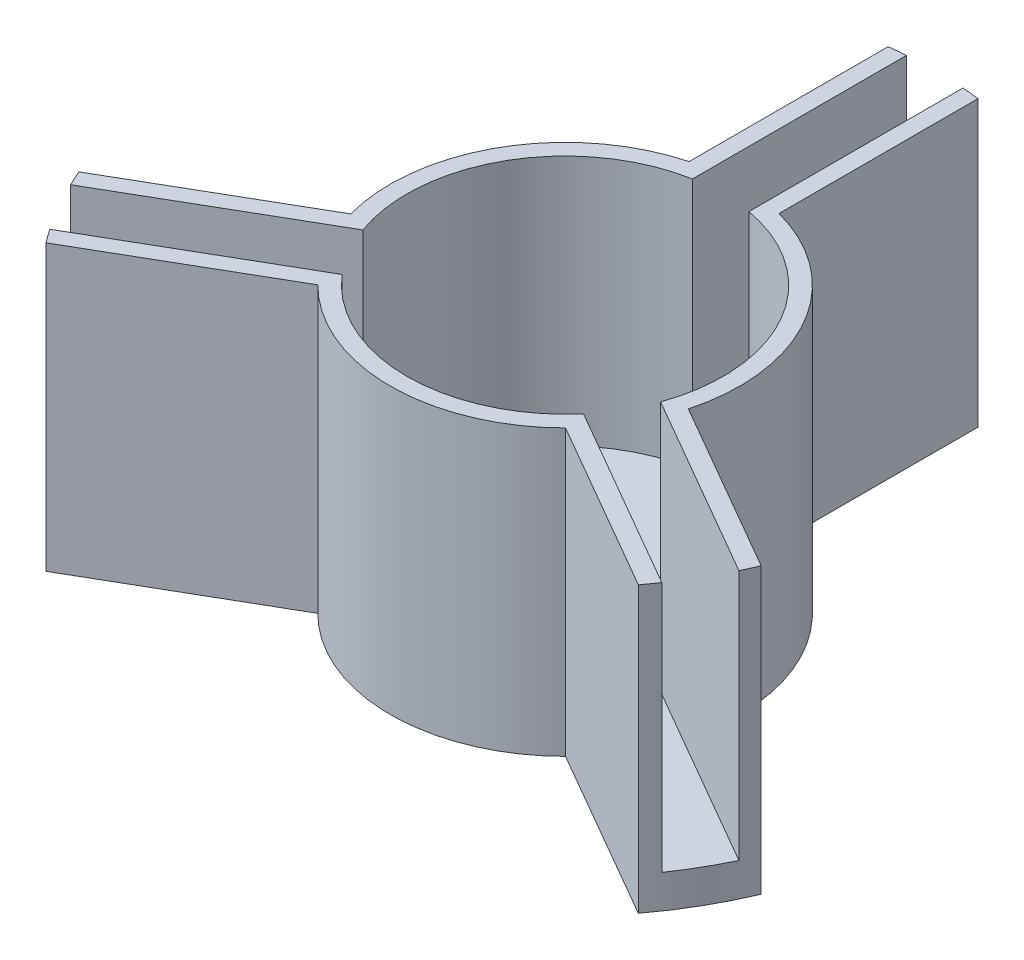
ISO-10303-21;
HEADER;
FILE_DESCRIPTION(('STEP AP214'),'2;1');
FILE_NAME('part.step','',(''),(''),'','','');
FILE_SCHEMA(('AUTOMOTIVE_DESIGN { 1 0 10303 214 1 1 1 1 }'));
ENDSEC;
DATA;
#1=APPLICATION_CONTEXT('core data for automotive mechanical design processes');
#2=APPLICATION_PROTOCOL_DEFINITION('international standard','automotive_design',2000,#1);
#3=PRODUCT_CONTEXT('',#1,'mechanical');
#4=PRODUCT('Part','Part','',(#3));
#5=PRODUCT_RELATED_PRODUCT_CATEGORY('part','',(#4));
#6=PRODUCT_DEFINITION_FORMATION('','',#4);
#7=PRODUCT_DEFINITION_CONTEXT('part definition',#1,'design');
#8=PRODUCT_DEFINITION('design','',#6,#7);
#9=PRODUCT_DEFINITION_SHAPE('','',#8);
#10=(LENGTH_UNIT() NAMED_UNIT(*) SI_UNIT(.MILLI.,.METRE.));
#11=(NAMED_UNIT(*) PLANE_ANGLE_UNIT() SI_UNIT($,.RADIAN.));
#12=(NAMED_UNIT(*) SI_UNIT($,.STERADIAN.) SOLID_ANGLE_UNIT());
#13=UNCERTAINTY_MEASURE_WITH_UNIT(LENGTH_MEASURE(1.E-05),#10,'distance_accuracy_value','');
#14=(GEOMETRIC_REPRESENTATION_CONTEXT(3) GLOBAL_UNCERTAINTY_ASSIGNED_CONTEXT((#13)) GLOBAL_UNIT_ASSIGNED_CONTEXT((#10,
#11,#12)) REPRESENTATION_CONTEXT('',''));
#15=CARTESIAN_POINT('',(0.,0.,0.));
#16=DIRECTION('',(0.,0.,1.));
#17=DIRECTION('',(1.,0.,0.));
#18=AXIS2_PLACEMENT_3D('',#15,#16,#17);
#19=CARTESIAN_POINT('',(0.,15.,0.));
#20=DIRECTION('',(0.,-1.,0.));
#21=DIRECTION('',(0.,0.,-1.));
#22=AXIS2_PLACEMENT_3D('',#19,#20,#21);
#23=CYLINDRICAL_SURFACE('',#22,22.15);
#24=CARTESIAN_POINT('',(0.,15.,0.));
#25=DIRECTION('',(0.,1.,0.));
#26=DIRECTION('',(0.,0.,1.));
#27=AXIS2_PLACEMENT_3D('',#24,#25,#26);
#28=CIRCLE('',#27,22.15);
#29=CARTESIAN_POINT('',(17.6969927064308,15.,13.3206211997991));
#30=VERTEX_POINT('',#29);
#31=CARTESIAN_POINT('',(18.2829625458743,15.,12.5042305059591));
#32=VERTEX_POINT('',#31);
#33=EDGE_CURVE('E51',#30,#32,#28,.T.);
#34=ORIENTED_EDGE('',*,*,#33,.F.);
#35=DIRECTION('',(0.,1.,0.));
#36=VECTOR('',#35,1.);
#37=CARTESIAN_POINT('',(17.6969927064308,-40.3534182513635,13.3206211997991));
#38=LINE('',#37,#36);
#39=CARTESIAN_POINT('',(17.6969927064308,-2.,13.3206211997991));
#40=VERTEX_POINT('',#39);
#41=EDGE_CURVE('E237',#40,#30,#38,.T.);
#42=ORIENTED_EDGE('',*,*,#41,.F.);
#43=CARTESIAN_POINT('',(0.,-2.,0.));
#44=DIRECTION('',(0.,-1.,0.));
#45=DIRECTION('',(0.,0.,-1.));
#46=AXIS2_PLACEMENT_3D('',#43,#44,#45);
#47=CIRCLE('',#46,22.15);
#48=CARTESIAN_POINT('',(20.3844927064308,-2.,8.66573465445768));
#49=VERTEX_POINT('',#48);
#50=EDGE_CURVE('E226',#49,#40,#47,.T.);
#51=ORIENTED_EDGE('',*,*,#50,.F.);
#52=DIRECTION('',(0.,1.,0.));
#53=VECTOR('',#52,1.);
#54=CARTESIAN_POINT('',(20.3844927064308,-38.3089459886184,8.66573465445768));
#55=LINE('',#54,#53);
#56=CARTESIAN_POINT('',(20.3844927064308,15.,8.66573465445768));
#57=VERTEX_POINT('',#56);
#58=EDGE_CURVE('E67',#49,#57,#55,.T.);
#59=ORIENTED_EDGE('',*,*,#58,.T.);
#60=CARTESIAN_POINT('',(19.9704625458742,15.,9.58139476818661));
#61=VERTEX_POINT('',#60);
#62=EDGE_CURVE('E372',#61,#57,#28,.T.);
#63=ORIENTED_EDGE('',*,*,#62,.F.);
#64=DIRECTION('',(0.,1.,0.));
#65=VECTOR('',#64,1.);
#66=CARTESIAN_POINT('',(19.9704625458742,-15.8007213444474,9.58139476818661));
#67=LINE('',#66,#65);
#68=CARTESIAN_POINT('',(19.9704625458742,0.,9.58139476818661));
#69=VERTEX_POINT('',#68);
#70=EDGE_CURVE('E296',#69,#61,#67,.T.);
#71=ORIENTED_EDGE('',*,*,#70,.F.);
#72=CARTESIAN_POINT('',(0.,0.,0.));
#73=DIRECTION('',(0.,-1.,0.));
#74=DIRECTION('',(0.,0.,-1.));
#75=AXIS2_PLACEMENT_3D('',#72,#73,#74);
#76=CIRCLE('',#75,22.15);
#77=CARTESIAN_POINT('',(18.2829625458743,0.,12.5042305059591));
#78=VERTEX_POINT('',#77);
#79=EDGE_CURVE('E322',#78,#69,#76,.F.);
#80=ORIENTED_EDGE('',*,*,#79,.F.);
#81=DIRECTION('',(0.,1.,0.));
#82=VECTOR('',#81,1.);
#83=CARTESIAN_POINT('',(18.2829625458743,-15.8007213444474,12.5042305059591));
#84=LINE('',#83,#82);
#85=EDGE_CURVE('E325',#78,#32,#84,.T.);
#86=ORIENTED_EDGE('',*,*,#85,.T.);
#87=EDGE_LOOP('',(#34,#42,#51,#59,#63,#71,#80,#86));
#88=FACE_BOUND('',#87,.T.);
#89=ADVANCED_FACE('F41',(#88),#23,.T.);
#90=CARTESIAN_POINT('',(2.68750000000006,15.,-21.9863558542565));
#91=VERTEX_POINT('',#90);
#92=CARTESIAN_POINT('',(1.6875,15.,-22.0856252741461));
#93=VERTEX_POINT('',#92);
#94=EDGE_CURVE('E366',#91,#93,#28,.T.);
#95=ORIENTED_EDGE('',*,*,#94,.F.);
#96=DIRECTION('',(0.,1.,0.));
#97=VECTOR('',#96,1.);
#98=CARTESIAN_POINT('',(2.68750000000006,-38.3089459886184,-21.9863558542565));
#99=LINE('',#98,#97);
#100=CARTESIAN_POINT('',(2.68750000000006,-2.,-21.9863558542565));
#101=VERTEX_POINT('',#100);
#102=EDGE_CURVE('E259',#101,#91,#99,.T.);
#103=ORIENTED_EDGE('',*,*,#102,.F.);
#104=CARTESIAN_POINT('',(-2.6875,-2.,-21.9863558542565));
#105=VERTEX_POINT('',#104);
#106=EDGE_CURVE('E360',#105,#101,#47,.T.);
#107=ORIENTED_EDGE('',*,*,#106,.F.);
#108=DIRECTION('',(0.,1.,0.));
#109=VECTOR('',#108,1.);
#110=CARTESIAN_POINT('',(-2.6875,-38.3089459886183,-21.9863558542565));
#111=LINE('',#110,#109);
#112=CARTESIAN_POINT('',(-2.6875,15.,-21.9863558542565));
#113=VERTEX_POINT('',#112);
#114=EDGE_CURVE('E278',#105,#113,#111,.T.);
#115=ORIENTED_EDGE('',*,*,#114,.T.);
#116=CARTESIAN_POINT('',(-1.6875,15.,-22.0856252741461));
#117=VERTEX_POINT('',#116);
#118=EDGE_CURVE('E11',#117,#113,#28,.T.);
#119=ORIENTED_EDGE('',*,*,#118,.F.);
#120=DIRECTION('',(0.,1.,0.));
#121=VECTOR('',#120,1.);
#122=CARTESIAN_POINT('',(-1.6875,-13.2876525247853,-22.0856252741461));
#123=LINE('',#122,#121);
#124=CARTESIAN_POINT('',(-1.6875,0.,-22.0856252741461));
#125=VERTEX_POINT('',#124);
#126=EDGE_CURVE('E346',#125,#117,#123,.T.);
#127=ORIENTED_EDGE('',*,*,#126,.F.);
#128=CARTESIAN_POINT('',(0.,0.,0.));
#129=DIRECTION('',(0.,-1.,0.));
#130=DIRECTION('',(0.,0.,-1.));
#131=AXIS2_PLACEMENT_3D('',#128,#129,#130);
#132=CIRCLE('',#131,22.15);
#133=CARTESIAN_POINT('',(1.6875,0.,-22.0856252741461));
#134=VERTEX_POINT('',#133);
#135=EDGE_CURVE('E343',#134,#125,#132,.F.);
#136=ORIENTED_EDGE('',*,*,#135,.F.);
#137=DIRECTION('',(0.,1.,0.));
#138=VECTOR('',#137,1.);
#139=CARTESIAN_POINT('',(1.6875,-13.2876525247853,-22.0856252741461));
#140=LINE('',#139,#138);
#141=EDGE_CURVE('E347',#134,#93,#140,.T.);
#142=ORIENTED_EDGE('',*,*,#141,.T.);
#143=EDGE_LOOP('',(#95,#103,#107,#115,#119,#127,#136,#142));
#144=FACE_BOUND('',#143,.T.);
#145=ADVANCED_FACE('F403',(#144),#23,.T.);
#146=CARTESIAN_POINT('',(0.,15.,0.));
#147=DIRECTION('',(0.,-1.,0.));
#148=DIRECTION('',(0.,0.,-1.));
#149=AXIS2_PLACEMENT_3D('',#146,#147,#148);
#150=CYLINDRICAL_SURFACE('',#149,9.45);
#151=DIRECTION('',(0.,1.,0.));
#152=VECTOR('',#151,1.);
#153=CARTESIAN_POINT('',(-7.20864919604707,-15.8007213444474,6.11047271234639));
#154=LINE('',#153,#152);
#155=CARTESIAN_POINT('',(-7.20864919604707,0.,6.11047271234639));
#156=VERTEX_POINT('',#155);
#157=CARTESIAN_POINT('',(-7.20864919604707,15.,6.11047271234639));
#158=VERTEX_POINT('',#157);
#159=EDGE_CURVE('E298',#156,#158,#154,.T.);
#160=ORIENTED_EDGE('',*,*,#159,.T.);
#161=CARTESIAN_POINT('',(0.,15.,0.));
#162=DIRECTION('',(0.,1.,0.));
#163=DIRECTION('',(0.,0.,1.));
#164=AXIS2_PLACEMENT_3D('',#161,#162,#163);
#165=CIRCLE('',#164,9.45);
#166=CARTESIAN_POINT('',(7.20864919604716,15.,6.11047271234629));
#167=VERTEX_POINT('',#166);
#168=EDGE_CURVE('E367',#158,#167,#165,.T.);
#169=ORIENTED_EDGE('',*,*,#168,.T.);
#170=DIRECTION('',(0.,1.,0.));
#171=VECTOR('',#170,1.);
#172=CARTESIAN_POINT('',(7.20864919604716,-15.8007213444474,6.11047271234629));
#173=LINE('',#172,#171);
#174=CARTESIAN_POINT('',(7.20864919604716,0.,6.11047271234629));
#175=VERTEX_POINT('',#174);
#176=EDGE_CURVE('E329',#175,#167,#173,.T.);
#177=ORIENTED_EDGE('',*,*,#176,.F.);
#178=CARTESIAN_POINT('',(0.,0.,0.));
#179=DIRECTION('',(0.,1.,0.));
#180=DIRECTION('',(0.,0.,1.));
#181=AXIS2_PLACEMENT_3D('',#178,#179,#180);
#182=CIRCLE('',#181,9.45);
#183=EDGE_CURVE('E378',#156,#175,#182,.T.);
#184=ORIENTED_EDGE('',*,*,#183,.F.);
#185=EDGE_LOOP('',(#160,#169,#177,#184));
#186=FACE_BOUND('',#185,.T.);
#187=ADVANCED_FACE('F393',(#186),#150,.F.);
#188=DIRECTION('',(0.,1.,0.));
#189=VECTOR('',#188,1.);
#190=CARTESIAN_POINT('',(8.89614919604713,-15.8007213444474,3.1876369745738));
#191=LINE('',#190,#189);
#192=CARTESIAN_POINT('',(8.89614919604713,0.,3.1876369745738));
#193=VERTEX_POINT('',#192);
#194=CARTESIAN_POINT('',(8.89614919604713,15.,3.1876369745738));
#195=VERTEX_POINT('',#194);
#196=EDGE_CURVE('E321',#193,#195,#191,.T.);
#197=ORIENTED_EDGE('',*,*,#196,.T.);
#198=CARTESIAN_POINT('',(1.6875,15.,-9.29810968692024));
#199=VERTEX_POINT('',#198);
#200=EDGE_CURVE('E368',#195,#199,#165,.T.);
#201=ORIENTED_EDGE('',*,*,#200,.T.);
#202=DIRECTION('',(0.,1.,0.));
#203=VECTOR('',#202,1.);
#204=CARTESIAN_POINT('',(1.6875,-13.2876525247853,-9.29810968692024));
#205=LINE('',#204,#203);
#206=CARTESIAN_POINT('',(1.6875,0.,-9.29810968692024));
#207=VERTEX_POINT('',#206);
#208=EDGE_CURVE('E351',#207,#199,#205,.T.);
#209=ORIENTED_EDGE('',*,*,#208,.F.);
#210=EDGE_CURVE('E363',#193,#207,#182,.T.);
#211=ORIENTED_EDGE('',*,*,#210,.F.);
#212=EDGE_LOOP('',(#197,#201,#209,#211));
#213=FACE_BOUND('',#212,.T.);
#214=ADVANCED_FACE('F390',(#213),#150,.F.);
#215=CARTESIAN_POINT('',(0.,15.,0.));
#216=DIRECTION('',(0.,1.,0.));
#217=DIRECTION('',(0.,0.,1.));
#218=AXIS2_PLACEMENT_3D('',#215,#216,#217);
#219=PLANE('',#218);
#220=DIRECTION('',(-0.866025403784434,0.,-0.500000000000008));
#221=VECTOR('',#220,1.);
#222=CARTESIAN_POINT('',(17.6969927064308,15.,13.3206211997991));
#223=LINE('',#222,#221);
#224=CARTESIAN_POINT('',(7.40181360748119,15.,7.376696775665));
#225=VERTEX_POINT('',#224);
#226=EDGE_CURVE('E220',#30,#225,#223,.T.);
#227=ORIENTED_EDGE('',*,*,#226,.F.);
#228=ORIENTED_EDGE('',*,*,#33,.T.);
#229=DIRECTION('',(0.866025403784443,0.,0.499999999999992));
#230=VECTOR('',#229,1.);
#231=CARTESIAN_POINT('',(7.20864919604716,15.,6.11047271234629));
#232=LINE('',#231,#230);
#233=EDGE_CURVE('E315',#167,#32,#232,.T.);
#234=ORIENTED_EDGE('',*,*,#233,.F.);
#235=ORIENTED_EDGE('',*,*,#168,.F.);
#236=DIRECTION('',(0.866025403784436,0.,-0.500000000000004));
#237=VECTOR('',#236,1.);
#238=CARTESIAN_POINT('',(-18.2829625458741,15.,12.5042305059594));
#239=LINE('',#238,#237);
#240=CARTESIAN_POINT('',(-18.2829625458741,15.,12.5042305059594));
#241=VERTEX_POINT('',#240);
#242=EDGE_CURVE('E294',#241,#158,#239,.T.);
#243=ORIENTED_EDGE('',*,*,#242,.F.);
#244=CARTESIAN_POINT('',(-17.696992706431,15.,13.3206211997988));
#245=VERTEX_POINT('',#244);
#246=EDGE_CURVE('E52',#241,#245,#28,.T.);
#247=ORIENTED_EDGE('',*,*,#246,.T.);
#248=DIRECTION('',(-0.866025403784443,0.,0.499999999999992));
#249=VECTOR('',#248,1.);
#250=CARTESIAN_POINT('',(-17.696992706431,15.,13.3206211997988));
#251=LINE('',#250,#249);
#252=CARTESIAN_POINT('',(-7.40181360748129,15.,7.37669677566489));
#253=VERTEX_POINT('',#252);
#254=EDGE_CURVE('E227',#253,#245,#251,.T.);
#255=ORIENTED_EDGE('',*,*,#254,.F.);
#256=CARTESIAN_POINT('',(0.,15.,0.));
#257=DIRECTION('',(0.,-1.,0.));
#258=DIRECTION('',(0.866025403784443,0.,-0.499999999999992));
#259=AXIS2_PLACEMENT_3D('',#256,#257,#258);
#260=CIRCLE('',#259,10.45);
#261=EDGE_CURVE('E229',#225,#253,#260,.T.);
#262=ORIENTED_EDGE('',*,*,#261,.F.);
#263=EDGE_LOOP('',(#227,#228,#234,#235,#243,#247,#255,#262));
#264=FACE_BOUND('',#263,.T.);
#265=ADVANCED_FACE('F392',(#264),#219,.T.);
#266=DIRECTION('',(0.,0.,1.));
#267=VECTOR('',#266,1.);
#268=CARTESIAN_POINT('',(2.68750000000006,15.,-21.9863558542565));
#269=LINE('',#268,#267);
#270=CARTESIAN_POINT('',(2.68750000000001,15.,-10.0985070059886));
#271=VERTEX_POINT('',#270);
#272=EDGE_CURVE('E240',#91,#271,#269,.T.);
#273=ORIENTED_EDGE('',*,*,#272,.F.);
#274=ORIENTED_EDGE('',*,*,#94,.T.);
#275=DIRECTION('',(0.,0.,-1.));
#276=VECTOR('',#275,1.);
#277=CARTESIAN_POINT('',(1.6875,15.,-9.29810968692024));
#278=LINE('',#277,#276);
#279=EDGE_CURVE('E336',#199,#93,#278,.T.);
#280=ORIENTED_EDGE('',*,*,#279,.F.);
#281=ORIENTED_EDGE('',*,*,#200,.F.);
#282=DIRECTION('',(-0.866025403784443,0.,-0.499999999999992));
#283=VECTOR('',#282,1.);
#284=CARTESIAN_POINT('',(19.9704625458742,15.,9.58139476818661));
#285=LINE('',#284,#283);
#286=EDGE_CURVE('E289',#61,#195,#285,.T.);
#287=ORIENTED_EDGE('',*,*,#286,.F.);
#288=ORIENTED_EDGE('',*,*,#62,.T.);
#289=DIRECTION('',(0.866025403784436,0.,0.500000000000004));
#290=VECTOR('',#289,1.);
#291=CARTESIAN_POINT('',(20.3844927064308,15.,8.66573465445768));
#292=LINE('',#291,#290);
#293=CARTESIAN_POINT('',(10.0893136074812,15.,2.72181023032365));
#294=VERTEX_POINT('',#293);
#295=EDGE_CURVE('E241',#294,#57,#292,.T.);
#296=ORIENTED_EDGE('',*,*,#295,.F.);
#297=CARTESIAN_POINT('',(0.,15.,0.));
#298=DIRECTION('',(0.,-1.,0.));
#299=DIRECTION('',(-0.866025403784436,0.,-0.500000000000004));
#300=AXIS2_PLACEMENT_3D('',#297,#298,#299);
#301=CIRCLE('',#300,10.45);
#302=EDGE_CURVE('E244',#271,#294,#301,.T.);
#303=ORIENTED_EDGE('',*,*,#302,.F.);
#304=EDGE_LOOP('',(#273,#274,#280,#281,#287,#288,#296,#303));
#305=FACE_BOUND('',#304,.T.);
#306=ADVANCED_FACE('F399',(#305),#219,.T.);
#307=DIRECTION('',(0.,1.,0.));
#308=VECTOR('',#307,1.);
#309=CARTESIAN_POINT('',(-8.89614919604709,-15.8007213444474,3.18763697457392));
#310=LINE('',#309,#308);
#311=CARTESIAN_POINT('',(-8.89614919604709,0.,3.18763697457392));
#312=VERTEX_POINT('',#311);
#313=CARTESIAN_POINT('',(-8.89614919604709,15.,3.18763697457392));
#314=VERTEX_POINT('',#313);
#315=EDGE_CURVE('E307',#312,#314,#310,.T.);
#316=ORIENTED_EDGE('',*,*,#315,.F.);
#317=CARTESIAN_POINT('',(-1.6875,0.,-9.29810968692024));
#318=VERTEX_POINT('',#317);
#319=EDGE_CURVE('E45',#318,#312,#182,.T.);
#320=ORIENTED_EDGE('',*,*,#319,.F.);
#321=DIRECTION('',(0.,1.,0.));
#322=VECTOR('',#321,1.);
#323=CARTESIAN_POINT('',(-1.6875,-13.2876525247853,-9.29810968692024));
#324=LINE('',#323,#322);
#325=CARTESIAN_POINT('',(-1.6875,15.,-9.29810968692024));
#326=VERTEX_POINT('',#325);
#327=EDGE_CURVE('E342',#318,#326,#324,.T.);
#328=ORIENTED_EDGE('',*,*,#327,.T.);
#329=EDGE_CURVE('E364',#326,#314,#165,.T.);
#330=ORIENTED_EDGE('',*,*,#329,.T.);
#331=EDGE_LOOP('',(#316,#320,#328,#330));
#332=FACE_BOUND('',#331,.T.);
#333=ADVANCED_FACE('F43',(#332),#150,.F.);
#334=CARTESIAN_POINT('',(-17.696992706431,-2.,13.3206211997988));
#335=VERTEX_POINT('',#334);
#336=CARTESIAN_POINT('',(-20.3844927064308,-2.,8.66573465445762));
#337=VERTEX_POINT('',#336);
#338=EDGE_CURVE('E359',#335,#337,#47,.T.);
#339=ORIENTED_EDGE('',*,*,#338,.F.);
#340=DIRECTION('',(0.,1.,0.));
#341=VECTOR('',#340,1.);
#342=CARTESIAN_POINT('',(-17.696992706431,-40.3534182513635,13.3206211997988));
#343=LINE('',#342,#341);
#344=EDGE_CURVE('E59',#335,#245,#343,.T.);
#345=ORIENTED_EDGE('',*,*,#344,.T.);
#346=ORIENTED_EDGE('',*,*,#246,.F.);
#347=DIRECTION('',(0.,1.,0.));
#348=VECTOR('',#347,1.);
#349=CARTESIAN_POINT('',(-18.2829625458741,-15.8007213444474,12.5042305059594));
#350=LINE('',#349,#348);
#351=CARTESIAN_POINT('',(-18.2829625458741,0.,12.5042305059594));
#352=VERTEX_POINT('',#351);
#353=EDGE_CURVE('E302',#352,#241,#350,.T.);
#354=ORIENTED_EDGE('',*,*,#353,.F.);
#355=CARTESIAN_POINT('',(0.,0.,0.));
#356=DIRECTION('',(0.,-1.,0.));
#357=DIRECTION('',(0.,0.,-1.));
#358=AXIS2_PLACEMENT_3D('',#355,#356,#357);
#359=CIRCLE('',#358,22.15);
#360=CARTESIAN_POINT('',(-19.9704625458741,0.,9.58139476818689));
#361=VERTEX_POINT('',#360);
#362=EDGE_CURVE('E299',#361,#352,#359,.F.);
#363=ORIENTED_EDGE('',*,*,#362,.F.);
#364=DIRECTION('',(0.,1.,0.));
#365=VECTOR('',#364,1.);
#366=CARTESIAN_POINT('',(-19.9704625458741,-15.8007213444474,9.58139476818689));
#367=LINE('',#366,#365);
#368=CARTESIAN_POINT('',(-19.9704625458741,15.,9.58139476818689));
#369=VERTEX_POINT('',#368);
#370=EDGE_CURVE('E303',#361,#369,#367,.T.);
#371=ORIENTED_EDGE('',*,*,#370,.T.);
#372=CARTESIAN_POINT('',(-20.3844927064308,15.,8.66573465445762));
#373=VERTEX_POINT('',#372);
#374=EDGE_CURVE('E50',#373,#369,#28,.T.);
#375=ORIENTED_EDGE('',*,*,#374,.F.);
#376=DIRECTION('',(0.,1.,0.));
#377=VECTOR('',#376,1.);
#378=CARTESIAN_POINT('',(-20.3844927064308,-38.3089459886183,8.66573465445762));
#379=LINE('',#378,#377);
#380=EDGE_CURVE('E285',#337,#373,#379,.T.);
#381=ORIENTED_EDGE('',*,*,#380,.F.);
#382=EDGE_LOOP('',(#339,#345,#346,#354,#363,#371,#375,#381));
#383=FACE_BOUND('',#382,.T.);
#384=ADVANCED_FACE('F405',(#383),#23,.T.);
#385=DIRECTION('',(0.866025403784439,0.,-0.5));
#386=VECTOR('',#385,1.);
#387=CARTESIAN_POINT('',(-20.3844927064308,15.,8.66573465445762));
#388=LINE('',#387,#386);
#389=CARTESIAN_POINT('',(-10.0893136074812,15.,2.72181023032364));
#390=VERTEX_POINT('',#389);
#391=EDGE_CURVE('E263',#373,#390,#388,.T.);
#392=ORIENTED_EDGE('',*,*,#391,.F.);
#393=ORIENTED_EDGE('',*,*,#374,.T.);
#394=DIRECTION('',(-0.866025403784436,0.,0.500000000000004));
#395=VECTOR('',#394,1.);
#396=CARTESIAN_POINT('',(-8.89614919604709,15.,3.18763697457392));
#397=LINE('',#396,#395);
#398=EDGE_CURVE('E290',#314,#369,#397,.T.);
#399=ORIENTED_EDGE('',*,*,#398,.F.);
#400=ORIENTED_EDGE('',*,*,#329,.F.);
#401=DIRECTION('',(0.,0.,1.));
#402=VECTOR('',#401,1.);
#403=CARTESIAN_POINT('',(-1.6875,15.,-22.0856252741461));
#404=LINE('',#403,#402);
#405=EDGE_CURVE('E314',#117,#326,#404,.T.);
#406=ORIENTED_EDGE('',*,*,#405,.F.);
#407=ORIENTED_EDGE('',*,*,#118,.T.);
#408=DIRECTION('',(0.,0.,-1.));
#409=VECTOR('',#408,1.);
#410=CARTESIAN_POINT('',(-2.6875,15.,-21.9863558542565));
#411=LINE('',#410,#409);
#412=CARTESIAN_POINT('',(-2.6875,15.,-10.0985070059886));
#413=VERTEX_POINT('',#412);
#414=EDGE_CURVE('E264',#413,#113,#411,.T.);
#415=ORIENTED_EDGE('',*,*,#414,.F.);
#416=CARTESIAN_POINT('',(0.,15.,0.));
#417=DIRECTION('',(0.,-1.,0.));
#418=DIRECTION('',(0.,0.,1.));
#419=AXIS2_PLACEMENT_3D('',#416,#417,#418);
#420=CIRCLE('',#419,10.45);
#421=EDGE_CURVE('E267',#390,#413,#420,.T.);
#422=ORIENTED_EDGE('',*,*,#421,.F.);
#423=EDGE_LOOP('',(#392,#393,#399,#400,#406,#407,#415,#422));
#424=FACE_BOUND('',#423,.T.);
#425=ADVANCED_FACE('F402',(#424),#219,.T.);
#426=CARTESIAN_POINT('',(0.,0.,0.));
#427=DIRECTION('',(0.,-1.,0.));
#428=DIRECTION('',(0.,0.,-1.));
#429=AXIS2_PLACEMENT_3D('',#426,#427,#428);
#430=PLANE('',#429);
#431=ORIENTED_EDGE('',*,*,#319,.T.);
#432=DIRECTION('',(-0.866025403784436,0.,0.500000000000004));
#433=VECTOR('',#432,1.);
#434=CARTESIAN_POINT('',(-8.89614919604709,0.,3.18763697457392));
#435=LINE('',#434,#433);
#436=EDGE_CURVE('E304',#312,#361,#435,.T.);
#437=ORIENTED_EDGE('',*,*,#436,.T.);
#438=ORIENTED_EDGE('',*,*,#362,.T.);
#439=DIRECTION('',(0.866025403784436,0.,-0.500000000000004));
#440=VECTOR('',#439,1.);
#441=CARTESIAN_POINT('',(-18.2829625458741,0.,12.5042305059594));
#442=LINE('',#441,#440);
#443=EDGE_CURVE('E293',#352,#156,#442,.T.);
#444=ORIENTED_EDGE('',*,*,#443,.T.);
#445=ORIENTED_EDGE('',*,*,#183,.T.);
#446=DIRECTION('',(0.866025403784443,0.,0.499999999999992));
#447=VECTOR('',#446,1.);
#448=CARTESIAN_POINT('',(7.20864919604716,0.,6.11047271234629));
#449=LINE('',#448,#447);
#450=EDGE_CURVE('E326',#175,#78,#449,.T.);
#451=ORIENTED_EDGE('',*,*,#450,.T.);
#452=ORIENTED_EDGE('',*,*,#79,.T.);
#453=DIRECTION('',(-0.866025403784443,0.,-0.499999999999992));
#454=VECTOR('',#453,1.);
#455=CARTESIAN_POINT('',(19.9704625458742,0.,9.58139476818661));
#456=LINE('',#455,#454);
#457=EDGE_CURVE('E318',#69,#193,#456,.T.);
#458=ORIENTED_EDGE('',*,*,#457,.T.);
#459=ORIENTED_EDGE('',*,*,#210,.T.);
#460=DIRECTION('',(0.,0.,-1.));
#461=VECTOR('',#460,1.);
#462=CARTESIAN_POINT('',(1.6875,0.,-9.29810968692024));
#463=LINE('',#462,#461);
#464=EDGE_CURVE('E348',#207,#134,#463,.T.);
#465=ORIENTED_EDGE('',*,*,#464,.T.);
#466=ORIENTED_EDGE('',*,*,#135,.T.);
#467=DIRECTION('',(0.,0.,1.));
#468=VECTOR('',#467,1.);
#469=CARTESIAN_POINT('',(-1.6875,0.,-22.0856252741461));
#470=LINE('',#469,#468);
#471=EDGE_CURVE('E339',#125,#318,#470,.T.);
#472=ORIENTED_EDGE('',*,*,#471,.T.);
#473=EDGE_LOOP('',(#431,#437,#438,#444,#445,#451,#452,#458,#459,#465,#466,#472));
#474=FACE_BOUND('',#473,.T.);
#475=ADVANCED_FACE('F384',(#474),#430,.F.);
#476=CARTESIAN_POINT('',(0.,-2.,0.));
#477=DIRECTION('',(0.,-1.,0.));
#478=DIRECTION('',(0.,0.,-1.));
#479=AXIS2_PLACEMENT_3D('',#476,#477,#478);
#480=PLANE('',#479);
#481=DIRECTION('',(-0.866025403784434,0.,-0.500000000000008));
#482=VECTOR('',#481,1.);
#483=CARTESIAN_POINT('',(17.6969927064308,-2.,13.3206211997991));
#484=LINE('',#483,#482);
#485=CARTESIAN_POINT('',(7.40181360748119,-2.,7.376696775665));
#486=VERTEX_POINT('',#485);
#487=EDGE_CURVE('E217',#40,#486,#484,.T.);
#488=ORIENTED_EDGE('',*,*,#487,.T.);
#489=CARTESIAN_POINT('',(0.,-2.,0.));
#490=DIRECTION('',(0.,-1.,0.));
#491=DIRECTION('',(0.,0.,-1.));
#492=AXIS2_PLACEMENT_3D('',#489,#490,#491);
#493=CIRCLE('',#492,10.45);
#494=CARTESIAN_POINT('',(-7.40181360748129,-2.,7.37669677566489));
#495=VERTEX_POINT('',#494);
#496=EDGE_CURVE('E205',#486,#495,#493,.T.);
#497=ORIENTED_EDGE('',*,*,#496,.T.);
#498=DIRECTION('',(-0.866025403784443,0.,0.499999999999992));
#499=VECTOR('',#498,1.);
#500=CARTESIAN_POINT('',(-17.696992706431,-2.,13.3206211997988));
#501=LINE('',#500,#499);
#502=EDGE_CURVE('E234',#495,#335,#501,.T.);
#503=ORIENTED_EDGE('',*,*,#502,.T.);
#504=ORIENTED_EDGE('',*,*,#338,.T.);
#505=DIRECTION('',(0.866025403784439,0.,-0.5));
#506=VECTOR('',#505,1.);
#507=CARTESIAN_POINT('',(-20.3844927064308,-2.,8.66573465445762));
#508=LINE('',#507,#506);
#509=CARTESIAN_POINT('',(-10.0893136074812,-2.,2.72181023032364));
#510=VERTEX_POINT('',#509);
#511=EDGE_CURVE('E266',#337,#510,#508,.T.);
#512=ORIENTED_EDGE('',*,*,#511,.T.);
#513=CARTESIAN_POINT('',(0.,-2.,0.));
#514=DIRECTION('',(0.,-1.,0.));
#515=DIRECTION('',(0.,0.,-1.));
#516=AXIS2_PLACEMENT_3D('',#513,#514,#515);
#517=CIRCLE('',#516,10.45);
#518=CARTESIAN_POINT('',(-2.6875,-2.,-10.0985070059886));
#519=VERTEX_POINT('',#518);
#520=EDGE_CURVE('E280',#510,#519,#517,.T.);
#521=ORIENTED_EDGE('',*,*,#520,.T.);
#522=DIRECTION('',(0.,0.,-1.));
#523=VECTOR('',#522,1.);
#524=CARTESIAN_POINT('',(-2.6875,-2.,-21.9863558542565));
#525=LINE('',#524,#523);
#526=EDGE_CURVE('E275',#519,#105,#525,.T.);
#527=ORIENTED_EDGE('',*,*,#526,.T.);
#528=ORIENTED_EDGE('',*,*,#106,.T.);
#529=DIRECTION('',(0.,0.,1.));
#530=VECTOR('',#529,1.);
#531=CARTESIAN_POINT('',(2.68750000000006,-2.,-21.9863558542565));
#532=LINE('',#531,#530);
#533=CARTESIAN_POINT('',(2.68750000000001,-2.,-10.0985070059886));
#534=VERTEX_POINT('',#533);
#535=EDGE_CURVE('E243',#101,#534,#532,.T.);
#536=ORIENTED_EDGE('',*,*,#535,.T.);
#537=CARTESIAN_POINT('',(0.,-2.,0.));
#538=DIRECTION('',(0.,-1.,0.));
#539=DIRECTION('',(0.,0.,-1.));
#540=AXIS2_PLACEMENT_3D('',#537,#538,#539);
#541=CIRCLE('',#540,10.45);
#542=CARTESIAN_POINT('',(10.0893136074812,-2.,2.72181023032365));
#543=VERTEX_POINT('',#542);
#544=EDGE_CURVE('E255',#534,#543,#541,.T.);
#545=ORIENTED_EDGE('',*,*,#544,.T.);
#546=DIRECTION('',(0.866025403784436,0.,0.500000000000004));
#547=VECTOR('',#546,1.);
#548=CARTESIAN_POINT('',(20.3844927064308,-2.,8.66573465445768));
#549=LINE('',#548,#547);
#550=EDGE_CURVE('E252',#543,#49,#549,.T.);
#551=ORIENTED_EDGE('',*,*,#550,.T.);
#552=ORIENTED_EDGE('',*,*,#50,.T.);
#553=EDGE_LOOP('',(#488,#497,#503,#504,#512,#521,#527,#528,#536,#545,#551,#552));
#554=FACE_BOUND('',#553,.T.);
#555=ADVANCED_FACE('F224',(#554),#480,.T.);
#556=CARTESIAN_POINT('',(-1.6875,-13.2876525247853,-22.0856252741461));
#557=DIRECTION('',(-1.,0.,0.));
#558=DIRECTION('',(0.,0.,1.));
#559=AXIS2_PLACEMENT_3D('',#556,#557,#558);
#560=PLANE('',#559);
#561=ORIENTED_EDGE('',*,*,#126,.T.);
#562=ORIENTED_EDGE('',*,*,#405,.T.);
#563=ORIENTED_EDGE('',*,*,#327,.F.);
#564=ORIENTED_EDGE('',*,*,#471,.F.);
#565=EDGE_LOOP('',(#561,#562,#563,#564));
#566=FACE_BOUND('',#565,.T.);
#567=ADVANCED_FACE('F498',(#566),#560,.F.);
#568=CARTESIAN_POINT('',(1.6875,-13.2876525247853,-9.29810968692024));
#569=DIRECTION('',(1.,0.,0.));
#570=DIRECTION('',(0.,0.,-1.));
#571=AXIS2_PLACEMENT_3D('',#568,#569,#570);
#572=PLANE('',#571);
#573=ORIENTED_EDGE('',*,*,#208,.T.);
#574=ORIENTED_EDGE('',*,*,#279,.T.);
#575=ORIENTED_EDGE('',*,*,#141,.F.);
#576=ORIENTED_EDGE('',*,*,#464,.F.);
#577=EDGE_LOOP('',(#573,#574,#575,#576));
#578=FACE_BOUND('',#577,.T.);
#579=ADVANCED_FACE('F388',(#578),#572,.F.);
#580=CARTESIAN_POINT('',(19.9704625458742,-15.8007213444474,9.58139476818661));
#581=DIRECTION('',(0.499999999999992,0.,-0.866025403784443));
#582=DIRECTION('',(-0.866025403784443,0.,-0.499999999999992));
#583=AXIS2_PLACEMENT_3D('',#580,#581,#582);
#584=PLANE('',#583);
#585=ORIENTED_EDGE('',*,*,#70,.T.);
#586=ORIENTED_EDGE('',*,*,#286,.T.);
#587=ORIENTED_EDGE('',*,*,#196,.F.);
#588=ORIENTED_EDGE('',*,*,#457,.F.);
#589=EDGE_LOOP('',(#585,#586,#587,#588));
#590=FACE_BOUND('',#589,.T.);
#591=ADVANCED_FACE('F491',(#590),#584,.F.);
#592=CARTESIAN_POINT('',(7.20864919604716,-15.8007213444474,6.11047271234629));
#593=DIRECTION('',(-0.499999999999992,0.,0.866025403784443));
#594=DIRECTION('',(0.866025403784443,0.,0.499999999999992));
#595=AXIS2_PLACEMENT_3D('',#592,#593,#594);
#596=PLANE('',#595);
#597=ORIENTED_EDGE('',*,*,#176,.T.);
#598=ORIENTED_EDGE('',*,*,#233,.T.);
#599=ORIENTED_EDGE('',*,*,#85,.F.);
#600=ORIENTED_EDGE('',*,*,#450,.F.);
#601=EDGE_LOOP('',(#597,#598,#599,#600));
#602=FACE_BOUND('',#601,.T.);
#603=ADVANCED_FACE('F487',(#602),#596,.F.);
#604=CARTESIAN_POINT('',(-18.2829625458741,-15.8007213444474,12.5042305059594));
#605=DIRECTION('',(0.500000000000004,0.,0.866025403784436));
#606=DIRECTION('',(0.866025403784436,0.,-0.500000000000004));
#607=AXIS2_PLACEMENT_3D('',#604,#605,#606);
#608=PLANE('',#607);
#609=ORIENTED_EDGE('',*,*,#353,.T.);
#610=ORIENTED_EDGE('',*,*,#242,.T.);
#611=ORIENTED_EDGE('',*,*,#159,.F.);
#612=ORIENTED_EDGE('',*,*,#443,.F.);
#613=EDGE_LOOP('',(#609,#610,#611,#612));
#614=FACE_BOUND('',#613,.T.);
#615=ADVANCED_FACE('F483',(#614),#608,.F.);
#616=CARTESIAN_POINT('',(-8.89614919604709,-15.8007213444474,3.18763697457392));
#617=DIRECTION('',(-0.500000000000004,0.,-0.866025403784436));
#618=DIRECTION('',(-0.866025403784436,0.,0.500000000000004));
#619=AXIS2_PLACEMENT_3D('',#616,#617,#618);
#620=PLANE('',#619);
#621=ORIENTED_EDGE('',*,*,#315,.T.);
#622=ORIENTED_EDGE('',*,*,#398,.T.);
#623=ORIENTED_EDGE('',*,*,#370,.F.);
#624=ORIENTED_EDGE('',*,*,#436,.F.);
#625=EDGE_LOOP('',(#621,#622,#623,#624));
#626=FACE_BOUND('',#625,.T.);
#627=ADVANCED_FACE('F480',(#626),#620,.F.);
#628=CARTESIAN_POINT('',(-20.3844927064308,-38.3089459886183,8.66573465445762));
#629=DIRECTION('',(0.5,0.,0.866025403784439));
#630=DIRECTION('',(0.866025403784439,0.,-0.5));
#631=AXIS2_PLACEMENT_3D('',#628,#629,#630);
#632=PLANE('',#631);
#633=ORIENTED_EDGE('',*,*,#380,.T.);
#634=ORIENTED_EDGE('',*,*,#391,.T.);
#635=DIRECTION('',(0.,1.,0.));
#636=VECTOR('',#635,1.);
#637=CARTESIAN_POINT('',(-10.0893136074812,-38.3089459886183,2.72181023032364));
#638=LINE('',#637,#636);
#639=EDGE_CURVE('E274',#510,#390,#638,.T.);
#640=ORIENTED_EDGE('',*,*,#639,.F.);
#641=ORIENTED_EDGE('',*,*,#511,.F.);
#642=EDGE_LOOP('',(#633,#634,#640,#641));
#643=FACE_BOUND('',#642,.T.);
#644=ADVANCED_FACE('F430',(#643),#632,.F.);
#645=CARTESIAN_POINT('',(0.,-38.3089459886183,0.));
#646=DIRECTION('',(0.,1.,0.));
#647=DIRECTION('',(0.,0.,1.));
#648=AXIS2_PLACEMENT_3D('',#645,#646,#647);
#649=CYLINDRICAL_SURFACE('',#648,10.45);
#650=ORIENTED_EDGE('',*,*,#639,.T.);
#651=ORIENTED_EDGE('',*,*,#421,.T.);
#652=DIRECTION('',(0.,1.,0.));
#653=VECTOR('',#652,1.);
#654=CARTESIAN_POINT('',(-2.6875,-38.3089459886183,-10.0985070059886));
#655=LINE('',#654,#653);
#656=EDGE_CURVE('E279',#519,#413,#655,.T.);
#657=ORIENTED_EDGE('',*,*,#656,.F.);
#658=ORIENTED_EDGE('',*,*,#520,.F.);
#659=EDGE_LOOP('',(#650,#651,#657,#658));
#660=FACE_BOUND('',#659,.T.);
#661=ADVANCED_FACE('F434',(#660),#649,.T.);
#662=CARTESIAN_POINT('',(-2.6875,-38.3089459886183,-21.9863558542565));
#663=DIRECTION('',(1.,0.,0.));
#664=DIRECTION('',(0.,0.,-1.));
#665=AXIS2_PLACEMENT_3D('',#662,#663,#664);
#666=PLANE('',#665);
#667=ORIENTED_EDGE('',*,*,#656,.T.);
#668=ORIENTED_EDGE('',*,*,#414,.T.);
#669=ORIENTED_EDGE('',*,*,#114,.F.);
#670=ORIENTED_EDGE('',*,*,#526,.F.);
#671=EDGE_LOOP('',(#667,#668,#669,#670));
#672=FACE_BOUND('',#671,.T.);
#673=ADVANCED_FACE('F474',(#672),#666,.F.);
#674=CARTESIAN_POINT('',(2.68750000000006,-38.3089459886184,-21.9863558542565));
#675=DIRECTION('',(-1.,0.,0.));
#676=DIRECTION('',(0.,0.,1.));
#677=AXIS2_PLACEMENT_3D('',#674,#675,#676);
#678=PLANE('',#677);
#679=ORIENTED_EDGE('',*,*,#102,.T.);
#680=ORIENTED_EDGE('',*,*,#272,.T.);
#681=DIRECTION('',(0.,1.,0.));
#682=VECTOR('',#681,1.);
#683=CARTESIAN_POINT('',(2.68750000000001,-38.3089459886184,-10.0985070059886));
#684=LINE('',#683,#682);
#685=EDGE_CURVE('E251',#534,#271,#684,.T.);
#686=ORIENTED_EDGE('',*,*,#685,.F.);
#687=ORIENTED_EDGE('',*,*,#535,.F.);
#688=EDGE_LOOP('',(#679,#680,#686,#687));
#689=FACE_BOUND('',#688,.T.);
#690=ADVANCED_FACE('F444',(#689),#678,.F.);
#691=CARTESIAN_POINT('',(0.,-38.3089459886184,0.));
#692=DIRECTION('',(0.,1.,0.));
#693=DIRECTION('',(0.,0.,1.));
#694=AXIS2_PLACEMENT_3D('',#691,#692,#693);
#695=CYLINDRICAL_SURFACE('',#694,10.45);
#696=ORIENTED_EDGE('',*,*,#685,.T.);
#697=ORIENTED_EDGE('',*,*,#302,.T.);
#698=DIRECTION('',(0.,1.,0.));
#699=VECTOR('',#698,1.);
#700=CARTESIAN_POINT('',(10.0893136074812,-38.3089459886184,2.72181023032365));
#701=LINE('',#700,#699);
#702=EDGE_CURVE('E254',#543,#294,#701,.T.);
#703=ORIENTED_EDGE('',*,*,#702,.F.);
#704=ORIENTED_EDGE('',*,*,#544,.F.);
#705=EDGE_LOOP('',(#696,#697,#703,#704));
#706=FACE_BOUND('',#705,.T.);
#707=ADVANCED_FACE('F452',(#706),#695,.T.);
#708=CARTESIAN_POINT('',(20.3844927064308,-38.3089459886184,8.66573465445768));
#709=DIRECTION('',(-0.500000000000004,0.,0.866025403784436));
#710=DIRECTION('',(0.866025403784436,0.,0.500000000000004));
#711=AXIS2_PLACEMENT_3D('',#708,#709,#710);
#712=PLANE('',#711);
#713=ORIENTED_EDGE('',*,*,#702,.T.);
#714=ORIENTED_EDGE('',*,*,#295,.T.);
#715=ORIENTED_EDGE('',*,*,#58,.F.);
#716=ORIENTED_EDGE('',*,*,#550,.F.);
#717=EDGE_LOOP('',(#713,#714,#715,#716));
#718=FACE_BOUND('',#717,.T.);
#719=ADVANCED_FACE('F467',(#718),#712,.F.);
#720=CARTESIAN_POINT('',(17.6969927064308,-40.3534182513635,13.3206211997991));
#721=DIRECTION('',(0.500000000000008,0.,-0.866025403784434));
#722=DIRECTION('',(-0.866025403784434,0.,-0.500000000000008));
#723=AXIS2_PLACEMENT_3D('',#720,#721,#722);
#724=PLANE('',#723);
#725=ORIENTED_EDGE('',*,*,#41,.T.);
#726=ORIENTED_EDGE('',*,*,#226,.T.);
#727=DIRECTION('',(0.,1.,0.));
#728=VECTOR('',#727,1.);
#729=CARTESIAN_POINT('',(7.40181360748119,-40.3534182513635,7.376696775665));
#730=LINE('',#729,#728);
#731=EDGE_CURVE('E209',#486,#225,#730,.T.);
#732=ORIENTED_EDGE('',*,*,#731,.F.);
#733=ORIENTED_EDGE('',*,*,#487,.F.);
#734=EDGE_LOOP('',(#725,#726,#732,#733));
#735=FACE_BOUND('',#734,.T.);
#736=ADVANCED_FACE('F216',(#735),#724,.F.);
#737=CARTESIAN_POINT('',(0.,-40.3534182513635,0.));
#738=DIRECTION('',(0.,1.,0.));
#739=DIRECTION('',(0.,0.,1.));
#740=AXIS2_PLACEMENT_3D('',#737,#738,#739);
#741=CYLINDRICAL_SURFACE('',#740,10.45);
#742=ORIENTED_EDGE('',*,*,#731,.T.);
#743=ORIENTED_EDGE('',*,*,#261,.T.);
#744=DIRECTION('',(0.,1.,0.));
#745=VECTOR('',#744,1.);
#746=CARTESIAN_POINT('',(-7.40181360748129,-40.3534182513635,7.37669677566489));
#747=LINE('',#746,#745);
#748=EDGE_CURVE('E211',#495,#253,#747,.T.);
#749=ORIENTED_EDGE('',*,*,#748,.F.);
#750=ORIENTED_EDGE('',*,*,#496,.F.);
#751=EDGE_LOOP('',(#742,#743,#749,#750));
#752=FACE_BOUND('',#751,.T.);
#753=ADVANCED_FACE('F207',(#752),#741,.T.);
#754=CARTESIAN_POINT('',(-17.696992706431,-40.3534182513635,13.3206211997988));
#755=DIRECTION('',(-0.499999999999992,0.,-0.866025403784443));
#756=DIRECTION('',(-0.866025403784443,0.,0.499999999999992));
#757=AXIS2_PLACEMENT_3D('',#754,#755,#756);
#758=PLANE('',#757);
#759=ORIENTED_EDGE('',*,*,#748,.T.);
#760=ORIENTED_EDGE('',*,*,#254,.T.);
#761=ORIENTED_EDGE('',*,*,#344,.F.);
#762=ORIENTED_EDGE('',*,*,#502,.F.);
#763=EDGE_LOOP('',(#759,#760,#761,#762));
#764=FACE_BOUND('',#763,.T.);
#765=ADVANCED_FACE('F457',(#764),#758,.F.);
#766=CLOSED_SHELL('',(#89,#145,#187,#214,#265,#306,#333,#384,#425,#475,#555,#567,#579,#591,#603,
#615,#627,#644,#661,#673,#690,#707,#719,#736,#753,#765));
#767=MANIFOLD_SOLID_BREP('B2',#766);
#768=ADVANCED_BREP_SHAPE_REPRESENTATION('',(#18,#767),#14);
#769=SHAPE_DEFINITION_REPRESENTATION(#9,#768);
ENDSEC;
END-ISO-10303-21;
